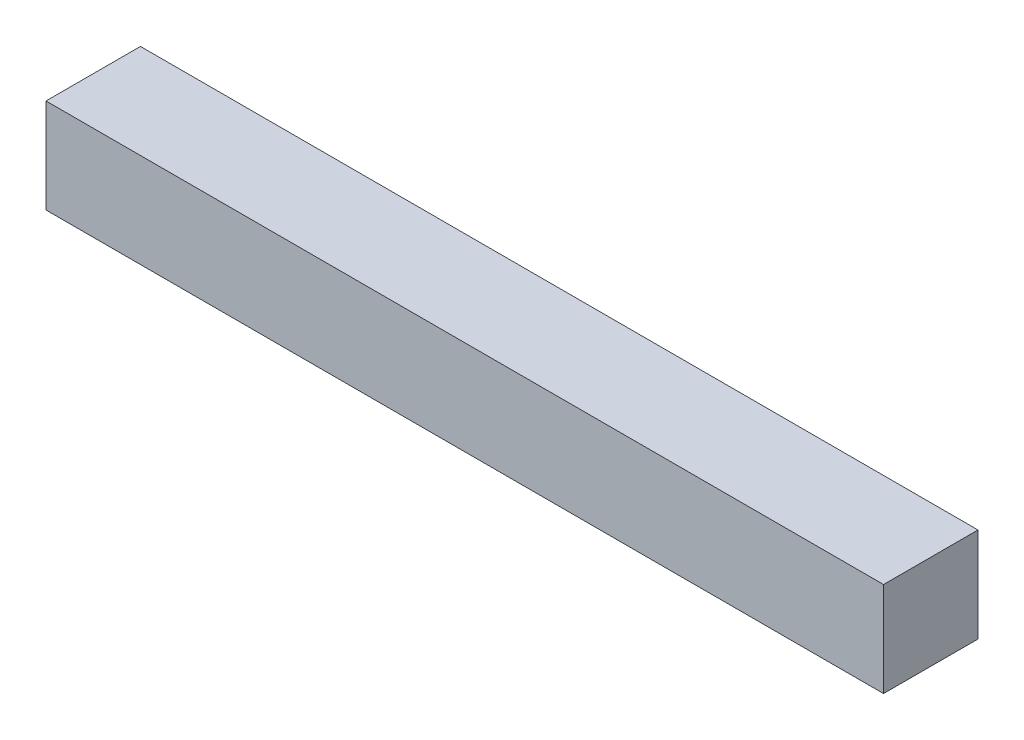
ISO-10303-21;
HEADER;
FILE_DESCRIPTION(('STEP AP214'),'2;1');
FILE_NAME('part.step','',(''),(''),'','','');
FILE_SCHEMA(('AUTOMOTIVE_DESIGN { 1 0 10303 214 1 1 1 1 }'));
ENDSEC;
DATA;
#1=APPLICATION_CONTEXT('core data for automotive mechanical design processes');
#2=APPLICATION_PROTOCOL_DEFINITION('international standard','automotive_design',2000,#1);
#3=PRODUCT_CONTEXT('',#1,'mechanical');
#4=PRODUCT('Part','Part','',(#3));
#5=PRODUCT_RELATED_PRODUCT_CATEGORY('part','',(#4));
#6=PRODUCT_DEFINITION_FORMATION('','',#4);
#7=PRODUCT_DEFINITION_CONTEXT('part definition',#1,'design');
#8=PRODUCT_DEFINITION('design','',#6,#7);
#9=PRODUCT_DEFINITION_SHAPE('','',#8);
#10=(LENGTH_UNIT() NAMED_UNIT(*) SI_UNIT(.MILLI.,.METRE.));
#11=(NAMED_UNIT(*) PLANE_ANGLE_UNIT() SI_UNIT($,.RADIAN.));
#12=(NAMED_UNIT(*) SI_UNIT($,.STERADIAN.) SOLID_ANGLE_UNIT());
#13=UNCERTAINTY_MEASURE_WITH_UNIT(LENGTH_MEASURE(1.E-05),#10,'distance_accuracy_value','');
#14=(GEOMETRIC_REPRESENTATION_CONTEXT(3) GLOBAL_UNCERTAINTY_ASSIGNED_CONTEXT((#13)) GLOBAL_UNIT_ASSIGNED_CONTEXT((#10,
#11,#12)) REPRESENTATION_CONTEXT('',''));
#15=CARTESIAN_POINT('',(0.,0.,0.));
#16=DIRECTION('',(0.,0.,1.));
#17=DIRECTION('',(1.,0.,0.));
#18=AXIS2_PLACEMENT_3D('',#15,#16,#17);
#19=CARTESIAN_POINT('',(168.91,0.,19.05));
#20=DIRECTION('',(0.,-1.,0.));
#21=DIRECTION('',(0.,0.,-1.));
#22=AXIS2_PLACEMENT_3D('',#19,#20,#21);
#23=PLANE('',#22);
#24=DIRECTION('',(-1.,0.,0.));
#25=VECTOR('',#24,1.);
#26=CARTESIAN_POINT('',(168.91,0.,0.));
#27=LINE('',#26,#25);
#28=CARTESIAN_POINT('',(168.91,0.,0.));
#29=VERTEX_POINT('',#28);
#30=CARTESIAN_POINT('',(0.,0.,0.));
#31=VERTEX_POINT('',#30);
#32=EDGE_CURVE('E67',#29,#31,#27,.T.);
#33=ORIENTED_EDGE('',*,*,#32,.F.);
#34=DIRECTION('',(0.,0.,-1.));
#35=VECTOR('',#34,1.);
#36=CARTESIAN_POINT('',(168.91,0.,19.05));
#37=LINE('',#36,#35);
#38=CARTESIAN_POINT('',(168.91,0.,19.05));
#39=VERTEX_POINT('',#38);
#40=EDGE_CURVE('E19',#39,#29,#37,.T.);
#41=ORIENTED_EDGE('',*,*,#40,.F.);
#42=DIRECTION('',(-1.,0.,0.));
#43=VECTOR('',#42,1.);
#44=CARTESIAN_POINT('',(168.91,0.,19.05));
#45=LINE('',#44,#43);
#46=CARTESIAN_POINT('',(0.,0.,19.05));
#47=VERTEX_POINT('',#46);
#48=EDGE_CURVE('E69',#39,#47,#45,.T.);
#49=ORIENTED_EDGE('',*,*,#48,.T.);
#50=DIRECTION('',(0.,0.,-1.));
#51=VECTOR('',#50,1.);
#52=CARTESIAN_POINT('',(0.,0.,19.05));
#53=LINE('',#52,#51);
#54=EDGE_CURVE('E11',#47,#31,#53,.T.);
#55=ORIENTED_EDGE('',*,*,#54,.T.);
#56=EDGE_LOOP('',(#33,#41,#49,#55));
#57=FACE_BOUND('',#56,.T.);
#58=ADVANCED_FACE('F16',(#57),#23,.T.);
#59=CARTESIAN_POINT('',(0.,0.,19.05));
#60=DIRECTION('',(-1.,0.,0.));
#61=DIRECTION('',(0.,0.,1.));
#62=AXIS2_PLACEMENT_3D('',#59,#60,#61);
#63=PLANE('',#62);
#64=DIRECTION('',(0.,1.,0.));
#65=VECTOR('',#64,1.);
#66=CARTESIAN_POINT('',(0.,0.,0.));
#67=LINE('',#66,#65);
#68=CARTESIAN_POINT('',(0.,19.05,0.));
#69=VERTEX_POINT('',#68);
#70=EDGE_CURVE('E72',#31,#69,#67,.T.);
#71=ORIENTED_EDGE('',*,*,#70,.F.);
#72=ORIENTED_EDGE('',*,*,#54,.F.);
#73=DIRECTION('',(0.,1.,0.));
#74=VECTOR('',#73,1.);
#75=CARTESIAN_POINT('',(0.,0.,19.05));
#76=LINE('',#75,#74);
#77=CARTESIAN_POINT('',(0.,19.05,19.05));
#78=VERTEX_POINT('',#77);
#79=EDGE_CURVE('E78',#47,#78,#76,.T.);
#80=ORIENTED_EDGE('',*,*,#79,.T.);
#81=DIRECTION('',(0.,0.,-1.));
#82=VECTOR('',#81,1.);
#83=CARTESIAN_POINT('',(0.,19.05,19.05));
#84=LINE('',#83,#82);
#85=EDGE_CURVE('E24',#78,#69,#84,.T.);
#86=ORIENTED_EDGE('',*,*,#85,.T.);
#87=EDGE_LOOP('',(#71,#72,#80,#86));
#88=FACE_BOUND('',#87,.T.);
#89=ADVANCED_FACE('F85',(#88),#63,.T.);
#90=CARTESIAN_POINT('',(0.,19.05,19.05));
#91=DIRECTION('',(0.,1.,0.));
#92=DIRECTION('',(0.,0.,1.));
#93=AXIS2_PLACEMENT_3D('',#90,#91,#92);
#94=PLANE('',#93);
#95=DIRECTION('',(1.,0.,0.));
#96=VECTOR('',#95,1.);
#97=CARTESIAN_POINT('',(0.,19.05,0.));
#98=LINE('',#97,#96);
#99=CARTESIAN_POINT('',(168.91,19.05,0.));
#100=VERTEX_POINT('',#99);
#101=EDGE_CURVE('E68',#69,#100,#98,.T.);
#102=ORIENTED_EDGE('',*,*,#101,.F.);
#103=ORIENTED_EDGE('',*,*,#85,.F.);
#104=DIRECTION('',(1.,0.,0.));
#105=VECTOR('',#104,1.);
#106=CARTESIAN_POINT('',(0.,19.05,19.05));
#107=LINE('',#106,#105);
#108=CARTESIAN_POINT('',(168.91,19.05,19.05));
#109=VERTEX_POINT('',#108);
#110=EDGE_CURVE('E80',#78,#109,#107,.T.);
#111=ORIENTED_EDGE('',*,*,#110,.T.);
#112=DIRECTION('',(0.,0.,-1.));
#113=VECTOR('',#112,1.);
#114=CARTESIAN_POINT('',(168.91,19.05,19.05));
#115=LINE('',#114,#113);
#116=EDGE_CURVE('E31',#109,#100,#115,.T.);
#117=ORIENTED_EDGE('',*,*,#116,.T.);
#118=EDGE_LOOP('',(#102,#103,#111,#117));
#119=FACE_BOUND('',#118,.T.);
#120=ADVANCED_FACE('F88',(#119),#94,.T.);
#121=CARTESIAN_POINT('',(168.91,19.05,19.05));
#122=DIRECTION('',(1.,0.,0.));
#123=DIRECTION('',(0.,0.,-1.));
#124=AXIS2_PLACEMENT_3D('',#121,#122,#123);
#125=PLANE('',#124);
#126=DIRECTION('',(0.,-1.,0.));
#127=VECTOR('',#126,1.);
#128=CARTESIAN_POINT('',(168.91,19.05,0.));
#129=LINE('',#128,#127);
#130=EDGE_CURVE('E55',#100,#29,#129,.T.);
#131=ORIENTED_EDGE('',*,*,#130,.F.);
#132=ORIENTED_EDGE('',*,*,#116,.F.);
#133=DIRECTION('',(0.,-1.,0.));
#134=VECTOR('',#133,1.);
#135=CARTESIAN_POINT('',(168.91,19.05,19.05));
#136=LINE('',#135,#134);
#137=EDGE_CURVE('E58',#109,#39,#136,.T.);
#138=ORIENTED_EDGE('',*,*,#137,.T.);
#139=ORIENTED_EDGE('',*,*,#40,.T.);
#140=EDGE_LOOP('',(#131,#132,#138,#139));
#141=FACE_BOUND('',#140,.T.);
#142=ADVANCED_FACE('F54',(#141),#125,.T.);
#143=CARTESIAN_POINT('',(0.,0.,19.05));
#144=DIRECTION('',(0.,0.,-1.));
#145=DIRECTION('',(-1.,0.,0.));
#146=AXIS2_PLACEMENT_3D('',#143,#144,#145);
#147=PLANE('',#146);
#148=ORIENTED_EDGE('',*,*,#48,.F.);
#149=ORIENTED_EDGE('',*,*,#137,.F.);
#150=ORIENTED_EDGE('',*,*,#110,.F.);
#151=ORIENTED_EDGE('',*,*,#79,.F.);
#152=EDGE_LOOP('',(#148,#149,#150,#151));
#153=FACE_BOUND('',#152,.T.);
#154=ADVANCED_FACE('F90',(#153),#147,.F.);
#155=CARTESIAN_POINT('',(0.,0.,0.));
#156=DIRECTION('',(0.,0.,-1.));
#157=DIRECTION('',(-1.,0.,0.));
#158=AXIS2_PLACEMENT_3D('',#155,#156,#157);
#159=PLANE('',#158);
#160=ORIENTED_EDGE('',*,*,#32,.T.);
#161=ORIENTED_EDGE('',*,*,#70,.T.);
#162=ORIENTED_EDGE('',*,*,#101,.T.);
#163=ORIENTED_EDGE('',*,*,#130,.T.);
#164=EDGE_LOOP('',(#160,#161,#162,#163));
#165=FACE_BOUND('',#164,.T.);
#166=ADVANCED_FACE('F65',(#165),#159,.T.);
#167=CLOSED_SHELL('',(#58,#89,#120,#142,#154,#166));
#168=MANIFOLD_SOLID_BREP('B1',#167);
#169=ADVANCED_BREP_SHAPE_REPRESENTATION('',(#18,#168),#14);
#170=SHAPE_DEFINITION_REPRESENTATION(#9,#169);
ENDSEC;
END-ISO-10303-21;
